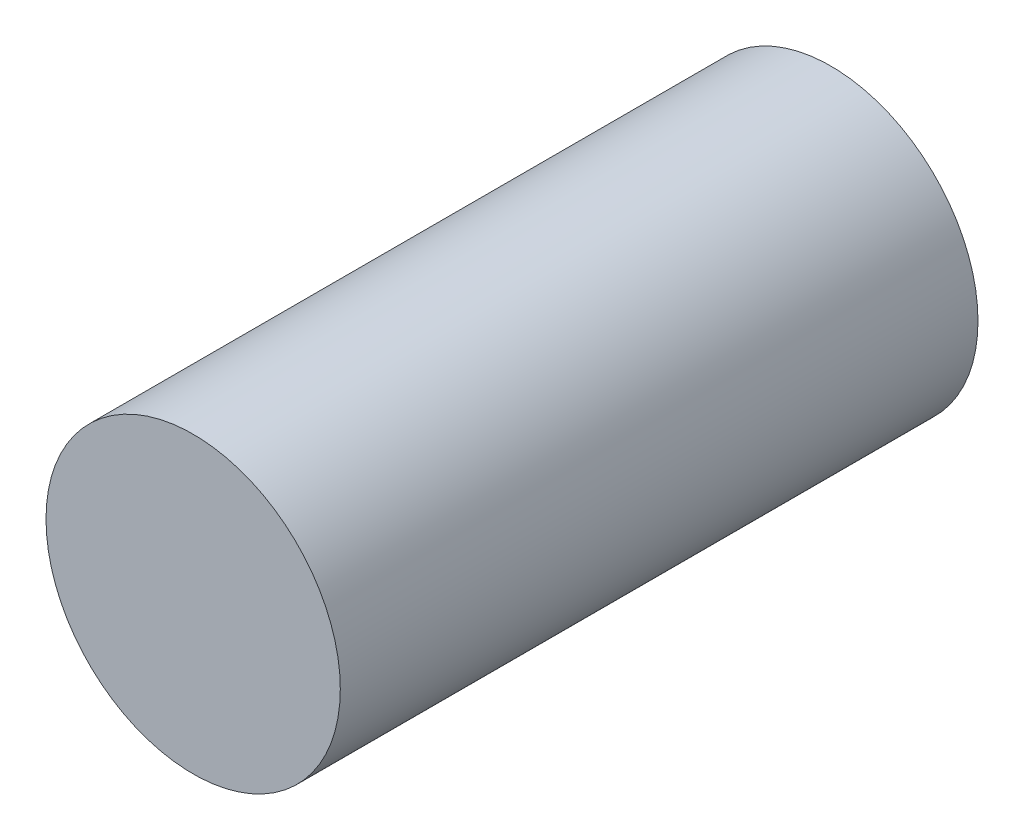
ISO-10303-21;
HEADER;
FILE_DESCRIPTION(('STEP AP214'),'2;1');
FILE_NAME('part.step','',(''),(''),'','','');
FILE_SCHEMA(('AUTOMOTIVE_DESIGN { 1 0 10303 214 1 1 1 1 }'));
ENDSEC;
DATA;
#1=APPLICATION_CONTEXT('core data for automotive mechanical design processes');
#2=APPLICATION_PROTOCOL_DEFINITION('international standard','automotive_design',2000,#1);
#3=PRODUCT_CONTEXT('',#1,'mechanical');
#4=PRODUCT('Part','Part','',(#3));
#5=PRODUCT_RELATED_PRODUCT_CATEGORY('part','',(#4));
#6=PRODUCT_DEFINITION_FORMATION('','',#4);
#7=PRODUCT_DEFINITION_CONTEXT('part definition',#1,'design');
#8=PRODUCT_DEFINITION('design','',#6,#7);
#9=PRODUCT_DEFINITION_SHAPE('','',#8);
#10=(LENGTH_UNIT() NAMED_UNIT(*) SI_UNIT(.MILLI.,.METRE.));
#11=(NAMED_UNIT(*) PLANE_ANGLE_UNIT() SI_UNIT($,.RADIAN.));
#12=(NAMED_UNIT(*) SI_UNIT($,.STERADIAN.) SOLID_ANGLE_UNIT());
#13=UNCERTAINTY_MEASURE_WITH_UNIT(LENGTH_MEASURE(1.E-05),#10,'distance_accuracy_value','');
#14=(GEOMETRIC_REPRESENTATION_CONTEXT(3) GLOBAL_UNCERTAINTY_ASSIGNED_CONTEXT((#13)) GLOBAL_UNIT_ASSIGNED_CONTEXT((#10,
#11,#12)) REPRESENTATION_CONTEXT('',''));
#15=CARTESIAN_POINT('',(0.,0.,0.));
#16=DIRECTION('',(0.,0.,1.));
#17=DIRECTION('',(1.,0.,0.));
#18=AXIS2_PLACEMENT_3D('',#15,#16,#17);
#19=CARTESIAN_POINT('',(0.,0.,1.3));
#20=DIRECTION('',(0.,0.,-1.));
#21=DIRECTION('',(-1.,0.,0.));
#22=AXIS2_PLACEMENT_3D('',#19,#20,#21);
#23=CYLINDRICAL_SURFACE('',#22,0.3);
#24=CARTESIAN_POINT('',(0.,0.,1.3));
#25=DIRECTION('',(0.,0.,1.));
#26=DIRECTION('',(1.,0.,0.));
#27=AXIS2_PLACEMENT_3D('',#24,#25,#26);
#28=CIRCLE('',#27,0.3);
#29=CARTESIAN_POINT('',(0.3,0.,1.3));
#30=VERTEX_POINT('',#29);
#31=EDGE_CURVE('E10',#30,#30,#28,.T.);
#32=ORIENTED_EDGE('',*,*,#31,.F.);
#33=EDGE_LOOP('',(#32));
#34=FACE_BOUND('',#33,.T.);
#35=CARTESIAN_POINT('',(0.,0.,0.));
#36=DIRECTION('',(0.,0.,1.));
#37=DIRECTION('',(1.,0.,0.));
#38=AXIS2_PLACEMENT_3D('',#35,#36,#37);
#39=CIRCLE('',#38,0.3);
#40=CARTESIAN_POINT('',(0.3,0.,0.));
#41=VERTEX_POINT('',#40);
#42=EDGE_CURVE('E35',#41,#41,#39,.T.);
#43=ORIENTED_EDGE('',*,*,#42,.T.);
#44=EDGE_LOOP('',(#43));
#45=FACE_BOUND('',#44,.T.);
#46=ADVANCED_FACE('F32',(#34,#45),#23,.T.);
#47=CARTESIAN_POINT('',(0.,0.,1.3));
#48=DIRECTION('',(0.,0.,1.));
#49=DIRECTION('',(1.,0.,0.));
#50=AXIS2_PLACEMENT_3D('',#47,#48,#49);
#51=PLANE('',#50);
#52=ORIENTED_EDGE('',*,*,#31,.T.);
#53=EDGE_LOOP('',(#52));
#54=FACE_BOUND('',#53,.T.);
#55=ADVANCED_FACE('F47',(#54),#51,.T.);
#56=CARTESIAN_POINT('',(0.,0.,0.));
#57=DIRECTION('',(0.,0.,1.));
#58=DIRECTION('',(1.,0.,0.));
#59=AXIS2_PLACEMENT_3D('',#56,#57,#58);
#60=PLANE('',#59);
#61=ORIENTED_EDGE('',*,*,#42,.F.);
#62=EDGE_LOOP('',(#61));
#63=FACE_BOUND('',#62,.T.);
#64=ADVANCED_FACE('F45',(#63),#60,.F.);
#65=CLOSED_SHELL('',(#46,#55,#64));
#66=MANIFOLD_SOLID_BREP('B2',#65);
#67=ADVANCED_BREP_SHAPE_REPRESENTATION('',(#18,#66),#14);
#68=SHAPE_DEFINITION_REPRESENTATION(#9,#67);
ENDSEC;
END-ISO-10303-21;
